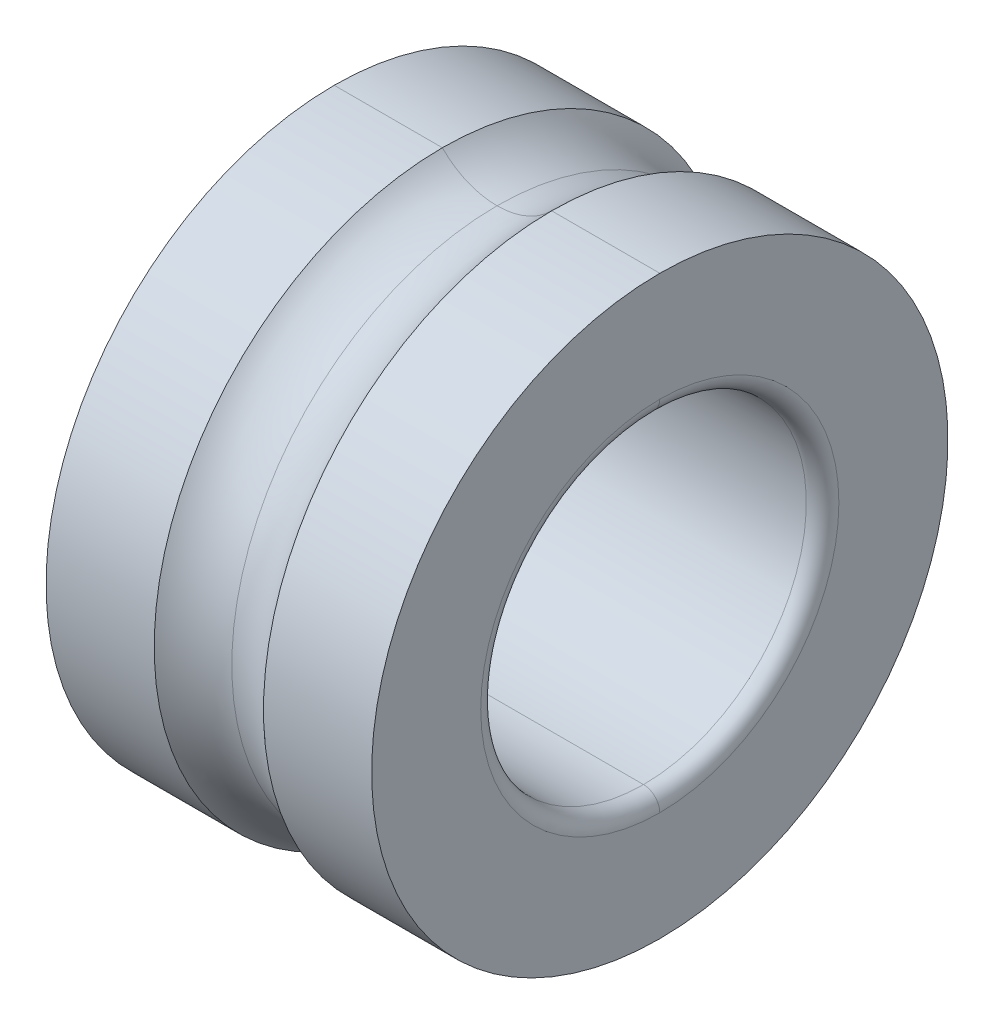
ISO-10303-21;
HEADER;
FILE_DESCRIPTION(('STEP AP214'),'2;1');
FILE_NAME('part.step','',(''),(''),'','','');
FILE_SCHEMA(('AUTOMOTIVE_DESIGN { 1 0 10303 214 1 1 1 1 }'));
ENDSEC;
DATA;
#1=APPLICATION_CONTEXT('core data for automotive mechanical design processes');
#2=APPLICATION_PROTOCOL_DEFINITION('international standard','automotive_design',2000,#1);
#3=PRODUCT_CONTEXT('',#1,'mechanical');
#4=PRODUCT('Part','Part','',(#3));
#5=PRODUCT_RELATED_PRODUCT_CATEGORY('part','',(#4));
#6=PRODUCT_DEFINITION_FORMATION('','',#4);
#7=PRODUCT_DEFINITION_CONTEXT('part definition',#1,'design');
#8=PRODUCT_DEFINITION('design','',#6,#7);
#9=PRODUCT_DEFINITION_SHAPE('','',#8);
#10=(LENGTH_UNIT() NAMED_UNIT(*) SI_UNIT(.MILLI.,.METRE.));
#11=(NAMED_UNIT(*) PLANE_ANGLE_UNIT() SI_UNIT($,.RADIAN.));
#12=(NAMED_UNIT(*) SI_UNIT($,.STERADIAN.) SOLID_ANGLE_UNIT());
#13=UNCERTAINTY_MEASURE_WITH_UNIT(LENGTH_MEASURE(1.E-05),#10,'distance_accuracy_value','');
#14=(GEOMETRIC_REPRESENTATION_CONTEXT(3) GLOBAL_UNCERTAINTY_ASSIGNED_CONTEXT((#13)) GLOBAL_UNIT_ASSIGNED_CONTEXT((#10,
#11,#12)) REPRESENTATION_CONTEXT('',''));
#15=CARTESIAN_POINT('',(0.,0.,0.));
#16=DIRECTION('',(0.,0.,1.));
#17=DIRECTION('',(1.,0.,0.));
#18=AXIS2_PLACEMENT_3D('',#15,#16,#17);
#19=CARTESIAN_POINT('',(-2.25171,0.,0.));
#20=DIRECTION('',(1.,0.,0.));
#21=DIRECTION('',(0.,-1.,0.));
#22=AXIS2_PLACEMENT_3D('',#19,#20,#21);
#23=TOROIDAL_SURFACE('',#22,2.75209,0.25019);
#24=CARTESIAN_POINT('',(-2.5019,0.,0.));
#25=DIRECTION('',(-1.,0.,0.));
#26=DIRECTION('',(0.,1.,0.));
#27=AXIS2_PLACEMENT_3D('',#24,#25,#26);
#28=CIRCLE('',#27,2.75209);
#29=CARTESIAN_POINT('',(-2.5019,2.75209,0.));
#30=VERTEX_POINT('',#29);
#31=CARTESIAN_POINT('',(-2.5019,-2.75209,0.));
#32=VERTEX_POINT('',#31);
#33=EDGE_CURVE('E198',#30,#32,#28,.T.);
#34=ORIENTED_EDGE('',*,*,#33,.T.);
#35=CARTESIAN_POINT('',(-2.25171,-2.75209,0.));
#36=DIRECTION('',(0.,0.,-1.));
#37=DIRECTION('',(-1.,0.,0.));
#38=AXIS2_PLACEMENT_3D('',#35,#36,#37);
#39=CIRCLE('',#38,0.25019);
#40=CARTESIAN_POINT('',(-2.25171,-2.5019,0.));
#41=VERTEX_POINT('',#40);
#42=EDGE_CURVE('E28',#32,#41,#39,.T.);
#43=ORIENTED_EDGE('',*,*,#42,.T.);
#44=CARTESIAN_POINT('',(-2.25171,0.,0.));
#45=DIRECTION('',(-1.,0.,0.));
#46=DIRECTION('',(0.,1.,0.));
#47=AXIS2_PLACEMENT_3D('',#44,#45,#46);
#48=CIRCLE('',#47,2.5019);
#49=CARTESIAN_POINT('',(-2.25171,2.5019,0.));
#50=VERTEX_POINT('',#49);
#51=EDGE_CURVE('E165',#50,#41,#48,.T.);
#52=ORIENTED_EDGE('',*,*,#51,.F.);
#53=CARTESIAN_POINT('',(-2.25171,2.75209,0.));
#54=DIRECTION('',(0.,0.,1.));
#55=DIRECTION('',(-1.,0.,0.));
#56=AXIS2_PLACEMENT_3D('',#53,#54,#55);
#57=CIRCLE('',#56,0.25019);
#58=EDGE_CURVE('E11',#30,#50,#57,.T.);
#59=ORIENTED_EDGE('',*,*,#58,.F.);
#60=EDGE_LOOP('',(#34,#43,#52,#59));
#61=FACE_BOUND('',#60,.T.);
#62=ADVANCED_FACE('F17',(#61),#23,.T.);
#63=CARTESIAN_POINT('',(-2.25171,0.,0.));
#64=DIRECTION('',(1.,0.,0.));
#65=DIRECTION('',(0.,-1.,0.));
#66=AXIS2_PLACEMENT_3D('',#63,#64,#65);
#67=TOROIDAL_SURFACE('',#66,2.75209,0.25019);
#68=CARTESIAN_POINT('',(-2.25171,0.,0.));
#69=DIRECTION('',(1.,0.,0.));
#70=DIRECTION('',(0.,1.,0.));
#71=AXIS2_PLACEMENT_3D('',#68,#69,#70);
#72=CIRCLE('',#71,2.5019);
#73=EDGE_CURVE('E201',#50,#41,#72,.T.);
#74=ORIENTED_EDGE('',*,*,#73,.T.);
#75=ORIENTED_EDGE('',*,*,#42,.F.);
#76=CARTESIAN_POINT('',(-2.5019,0.,0.));
#77=DIRECTION('',(1.,0.,0.));
#78=DIRECTION('',(0.,1.,0.));
#79=AXIS2_PLACEMENT_3D('',#76,#77,#78);
#80=CIRCLE('',#79,2.75209);
#81=EDGE_CURVE('E217',#30,#32,#80,.T.);
#82=ORIENTED_EDGE('',*,*,#81,.F.);
#83=ORIENTED_EDGE('',*,*,#58,.T.);
#84=EDGE_LOOP('',(#74,#75,#82,#83));
#85=FACE_BOUND('',#84,.T.);
#86=ADVANCED_FACE('F294',(#85),#67,.T.);
#87=CARTESIAN_POINT('',(-2.5019,0.,0.));
#88=DIRECTION('',(1.,0.,0.));
#89=DIRECTION('',(0.,1.,0.));
#90=AXIS2_PLACEMENT_3D('',#87,#88,#89);
#91=PLANE('',#90);
#92=ORIENTED_EDGE('',*,*,#33,.F.);
#93=ORIENTED_EDGE('',*,*,#81,.T.);
#94=EDGE_LOOP('',(#92,#93));
#95=FACE_BOUND('',#94,.T.);
#96=CARTESIAN_POINT('',(-2.5019,0.,0.));
#97=DIRECTION('',(1.,0.,0.));
#98=DIRECTION('',(0.,1.,0.));
#99=AXIS2_PLACEMENT_3D('',#96,#97,#98);
#100=CIRCLE('',#99,4.4283249);
#101=CARTESIAN_POINT('',(-2.5019,4.4283249,0.));
#102=VERTEX_POINT('',#101);
#103=CARTESIAN_POINT('',(-2.5019,-4.4283249,0.));
#104=VERTEX_POINT('',#103);
#105=EDGE_CURVE('E110',#102,#104,#100,.T.);
#106=ORIENTED_EDGE('',*,*,#105,.F.);
#107=CARTESIAN_POINT('',(-2.5019,0.,0.));
#108=DIRECTION('',(-1.,0.,0.));
#109=DIRECTION('',(0.,1.,0.));
#110=AXIS2_PLACEMENT_3D('',#107,#108,#109);
#111=CIRCLE('',#110,4.4283249);
#112=EDGE_CURVE('E194',#102,#104,#111,.T.);
#113=ORIENTED_EDGE('',*,*,#112,.T.);
#114=EDGE_LOOP('',(#106,#113));
#115=FACE_BOUND('',#114,.T.);
#116=ADVANCED_FACE('F289',(#95,#115),#91,.F.);
#117=CARTESIAN_POINT('',(-2.75209,0.,0.));
#118=DIRECTION('',(1.,0.,0.));
#119=DIRECTION('',(0.,-1.,0.));
#120=AXIS2_PLACEMENT_3D('',#117,#118,#119);
#121=CYLINDRICAL_SURFACE('',#120,4.4283249);
#122=CARTESIAN_POINT('',(-0.839755569912454,0.,0.));
#123=DIRECTION('',(-1.,0.,0.));
#124=DIRECTION('',(0.,1.,0.));
#125=AXIS2_PLACEMENT_3D('',#122,#123,#124);
#126=CIRCLE('',#125,4.4283249);
#127=CARTESIAN_POINT('',(-0.839755569912454,4.4283249,0.));
#128=VERTEX_POINT('',#127);
#129=CARTESIAN_POINT('',(-0.839755569912454,-4.4283249,0.));
#130=VERTEX_POINT('',#129);
#131=EDGE_CURVE('E128',#128,#130,#126,.T.);
#132=ORIENTED_EDGE('',*,*,#131,.T.);
#133=DIRECTION('',(-1.,0.,0.));
#134=VECTOR('',#133,1.);
#135=CARTESIAN_POINT('',(-0.839755569912453,-4.4283249,0.));
#136=LINE('',#135,#134);
#137=EDGE_CURVE('E103',#130,#104,#136,.T.);
#138=ORIENTED_EDGE('',*,*,#137,.T.);
#139=ORIENTED_EDGE('',*,*,#112,.F.);
#140=DIRECTION('',(-1.,0.,0.));
#141=VECTOR('',#140,1.);
#142=CARTESIAN_POINT('',(-0.839755569912453,4.4283249,0.));
#143=LINE('',#142,#141);
#144=EDGE_CURVE('E115',#128,#102,#143,.T.);
#145=ORIENTED_EDGE('',*,*,#144,.F.);
#146=EDGE_LOOP('',(#132,#138,#139,#145));
#147=FACE_BOUND('',#146,.T.);
#148=ADVANCED_FACE('F129',(#147),#121,.T.);
#149=CARTESIAN_POINT('',(-2.75209,0.,0.));
#150=DIRECTION('',(1.,0.,0.));
#151=DIRECTION('',(0.,-1.,0.));
#152=AXIS2_PLACEMENT_3D('',#149,#150,#151);
#153=CYLINDRICAL_SURFACE('',#152,4.4283249);
#154=ORIENTED_EDGE('',*,*,#105,.T.);
#155=ORIENTED_EDGE('',*,*,#137,.F.);
#156=CARTESIAN_POINT('',(-0.839755569912454,0.,0.));
#157=DIRECTION('',(1.,0.,0.));
#158=DIRECTION('',(0.,1.,0.));
#159=AXIS2_PLACEMENT_3D('',#156,#157,#158);
#160=CIRCLE('',#159,4.4283249);
#161=EDGE_CURVE('E107',#128,#130,#160,.T.);
#162=ORIENTED_EDGE('',*,*,#161,.F.);
#163=ORIENTED_EDGE('',*,*,#144,.T.);
#164=EDGE_LOOP('',(#154,#155,#162,#163));
#165=FACE_BOUND('',#164,.T.);
#166=ADVANCED_FACE('F105',(#165),#153,.T.);
#167=CARTESIAN_POINT('',(0.,0.,0.));
#168=DIRECTION('',(1.,0.,0.));
#169=DIRECTION('',(0.,-1.,0.));
#170=AXIS2_PLACEMENT_3D('',#167,#168,#169);
#171=TOROIDAL_SURFACE('',#170,5.25145,1.175893);
#172=CARTESIAN_POINT('',(0.,0.,0.));
#173=DIRECTION('',(1.,0.,0.));
#174=DIRECTION('',(0.,0.,-1.));
#175=AXIS2_PLACEMENT_3D('',#172,#173,#174);
#176=CIRCLE('',#175,4.075557);
#177=CARTESIAN_POINT('',(0.,4.075557,0.));
#178=VERTEX_POINT('',#177);
#179=CARTESIAN_POINT('',(0.,-4.075557,0.));
#180=VERTEX_POINT('',#179);
#181=EDGE_CURVE('E184',#178,#180,#176,.T.);
#182=ORIENTED_EDGE('',*,*,#181,.F.);
#183=CARTESIAN_POINT('',(0.,5.25145,0.));
#184=DIRECTION('',(0.,0.,-1.));
#185=DIRECTION('',(0.714142842854285,-0.7,0.));
#186=AXIS2_PLACEMENT_3D('',#183,#184,#185);
#187=CIRCLE('',#186,1.175893);
#188=EDGE_CURVE('E124',#178,#128,#187,.T.);
#189=ORIENTED_EDGE('',*,*,#188,.T.);
#190=ORIENTED_EDGE('',*,*,#161,.T.);
#191=CARTESIAN_POINT('',(0.,-5.25145,0.));
#192=DIRECTION('',(0.,0.,1.));
#193=DIRECTION('',(0.714142842854285,0.7,0.));
#194=AXIS2_PLACEMENT_3D('',#191,#192,#193);
#195=CIRCLE('',#194,1.175893);
#196=EDGE_CURVE('E122',#180,#130,#195,.T.);
#197=ORIENTED_EDGE('',*,*,#196,.F.);
#198=EDGE_LOOP('',(#182,#189,#190,#197));
#199=FACE_BOUND('',#198,.T.);
#200=ADVANCED_FACE('F120',(#199),#171,.F.);
#201=CARTESIAN_POINT('',(0.,0.,0.));
#202=DIRECTION('',(1.,0.,0.));
#203=DIRECTION('',(0.,-1.,0.));
#204=AXIS2_PLACEMENT_3D('',#201,#202,#203);
#205=TOROIDAL_SURFACE('',#204,5.25145,1.175893);
#206=CARTESIAN_POINT('',(0.,0.,0.));
#207=DIRECTION('',(1.,0.,0.));
#208=DIRECTION('',(0.,0.,-1.));
#209=AXIS2_PLACEMENT_3D('',#206,#207,#208);
#210=CIRCLE('',#209,4.075557);
#211=EDGE_CURVE('E135',#180,#178,#210,.T.);
#212=ORIENTED_EDGE('',*,*,#211,.F.);
#213=ORIENTED_EDGE('',*,*,#196,.T.);
#214=ORIENTED_EDGE('',*,*,#131,.F.);
#215=ORIENTED_EDGE('',*,*,#188,.F.);
#216=EDGE_LOOP('',(#212,#213,#214,#215));
#217=FACE_BOUND('',#216,.T.);
#218=ADVANCED_FACE('F133',(#217),#205,.F.);
#219=CARTESIAN_POINT('',(-2.75209,0.,0.));
#220=DIRECTION('',(1.,0.,0.));
#221=DIRECTION('',(0.,-1.,0.));
#222=AXIS2_PLACEMENT_3D('',#219,#220,#221);
#223=CYLINDRICAL_SURFACE('',#222,4.4283249);
#224=CARTESIAN_POINT('',(2.5019,0.,0.));
#225=DIRECTION('',(-1.,0.,0.));
#226=DIRECTION('',(0.,1.,0.));
#227=AXIS2_PLACEMENT_3D('',#224,#225,#226);
#228=CIRCLE('',#227,4.4283249);
#229=CARTESIAN_POINT('',(2.5019,4.4283249,0.));
#230=VERTEX_POINT('',#229);
#231=CARTESIAN_POINT('',(2.5019,-4.4283249,0.));
#232=VERTEX_POINT('',#231);
#233=EDGE_CURVE('E191',#230,#232,#228,.T.);
#234=ORIENTED_EDGE('',*,*,#233,.T.);
#235=DIRECTION('',(-1.,0.,0.));
#236=VECTOR('',#235,1.);
#237=CARTESIAN_POINT('',(2.5019,-4.4283249,0.));
#238=LINE('',#237,#236);
#239=CARTESIAN_POINT('',(0.839755569912454,-4.4283249,0.));
#240=VERTEX_POINT('',#239);
#241=EDGE_CURVE('E145',#232,#240,#238,.T.);
#242=ORIENTED_EDGE('',*,*,#241,.T.);
#243=CARTESIAN_POINT('',(0.839755569912454,0.,0.));
#244=DIRECTION('',(-1.,0.,0.));
#245=DIRECTION('',(0.,1.,0.));
#246=AXIS2_PLACEMENT_3D('',#243,#244,#245);
#247=CIRCLE('',#246,4.4283249);
#248=CARTESIAN_POINT('',(0.839755569912454,4.4283249,0.));
#249=VERTEX_POINT('',#248);
#250=EDGE_CURVE('E173',#249,#240,#247,.T.);
#251=ORIENTED_EDGE('',*,*,#250,.F.);
#252=DIRECTION('',(-1.,0.,0.));
#253=VECTOR('',#252,1.);
#254=CARTESIAN_POINT('',(2.5019,4.4283249,0.));
#255=LINE('',#254,#253);
#256=EDGE_CURVE('E138',#230,#249,#255,.T.);
#257=ORIENTED_EDGE('',*,*,#256,.F.);
#258=EDGE_LOOP('',(#234,#242,#251,#257));
#259=FACE_BOUND('',#258,.T.);
#260=ADVANCED_FACE('F241',(#259),#223,.T.);
#261=CARTESIAN_POINT('',(-2.75209,0.,0.));
#262=DIRECTION('',(1.,0.,0.));
#263=DIRECTION('',(0.,-1.,0.));
#264=AXIS2_PLACEMENT_3D('',#261,#262,#263);
#265=CYLINDRICAL_SURFACE('',#264,4.4283249);
#266=CARTESIAN_POINT('',(0.839755569912454,0.,0.));
#267=DIRECTION('',(1.,0.,0.));
#268=DIRECTION('',(0.,1.,0.));
#269=AXIS2_PLACEMENT_3D('',#266,#267,#268);
#270=CIRCLE('',#269,4.4283249);
#271=EDGE_CURVE('E176',#249,#240,#270,.T.);
#272=ORIENTED_EDGE('',*,*,#271,.T.);
#273=ORIENTED_EDGE('',*,*,#241,.F.);
#274=CARTESIAN_POINT('',(2.5019,0.,0.));
#275=DIRECTION('',(1.,0.,0.));
#276=DIRECTION('',(0.,1.,0.));
#277=AXIS2_PLACEMENT_3D('',#274,#275,#276);
#278=CIRCLE('',#277,4.4283249);
#279=EDGE_CURVE('E213',#230,#232,#278,.T.);
#280=ORIENTED_EDGE('',*,*,#279,.F.);
#281=ORIENTED_EDGE('',*,*,#256,.T.);
#282=EDGE_LOOP('',(#272,#273,#280,#281));
#283=FACE_BOUND('',#282,.T.);
#284=ADVANCED_FACE('F250',(#283),#265,.T.);
#285=CARTESIAN_POINT('',(2.5019,0.,0.));
#286=DIRECTION('',(1.,0.,0.));
#287=DIRECTION('',(0.,1.,0.));
#288=AXIS2_PLACEMENT_3D('',#285,#286,#287);
#289=PLANE('',#288);
#290=CARTESIAN_POINT('',(2.5019,0.,0.));
#291=DIRECTION('',(1.,0.,0.));
#292=DIRECTION('',(0.,1.,0.));
#293=AXIS2_PLACEMENT_3D('',#290,#291,#292);
#294=CIRCLE('',#293,2.75209);
#295=CARTESIAN_POINT('',(2.5019,2.75209,0.));
#296=VERTEX_POINT('',#295);
#297=CARTESIAN_POINT('',(2.5019,-2.75209,0.));
#298=VERTEX_POINT('',#297);
#299=EDGE_CURVE('E204',#296,#298,#294,.T.);
#300=ORIENTED_EDGE('',*,*,#299,.F.);
#301=CARTESIAN_POINT('',(2.5019,0.,0.));
#302=DIRECTION('',(-1.,0.,0.));
#303=DIRECTION('',(0.,1.,0.));
#304=AXIS2_PLACEMENT_3D('',#301,#302,#303);
#305=CIRCLE('',#304,2.75209);
#306=EDGE_CURVE('E189',#296,#298,#305,.T.);
#307=ORIENTED_EDGE('',*,*,#306,.T.);
#308=EDGE_LOOP('',(#300,#307));
#309=FACE_BOUND('',#308,.T.);
#310=ORIENTED_EDGE('',*,*,#233,.F.);
#311=ORIENTED_EDGE('',*,*,#279,.T.);
#312=EDGE_LOOP('',(#310,#311));
#313=FACE_BOUND('',#312,.T.);
#314=ADVANCED_FACE('F331',(#309,#313),#289,.T.);
#315=CARTESIAN_POINT('',(2.25171,0.,0.));
#316=DIRECTION('',(1.,0.,0.));
#317=DIRECTION('',(0.,-1.,0.));
#318=AXIS2_PLACEMENT_3D('',#315,#316,#317);
#319=TOROIDAL_SURFACE('',#318,2.75209,0.25019);
#320=CARTESIAN_POINT('',(2.25171,0.,0.));
#321=DIRECTION('',(-1.,0.,0.));
#322=DIRECTION('',(0.,1.,0.));
#323=AXIS2_PLACEMENT_3D('',#320,#321,#322);
#324=CIRCLE('',#323,2.5019);
#325=CARTESIAN_POINT('',(2.25171,2.5019,0.));
#326=VERTEX_POINT('',#325);
#327=CARTESIAN_POINT('',(2.25171,-2.5019,0.));
#328=VERTEX_POINT('',#327);
#329=EDGE_CURVE('E150',#326,#328,#324,.T.);
#330=ORIENTED_EDGE('',*,*,#329,.T.);
#331=CARTESIAN_POINT('',(2.25171,-2.75209,0.));
#332=DIRECTION('',(0.,0.,-1.));
#333=DIRECTION('',(0.,1.,0.));
#334=AXIS2_PLACEMENT_3D('',#331,#332,#333);
#335=CIRCLE('',#334,0.25019);
#336=EDGE_CURVE('E21',#328,#298,#335,.T.);
#337=ORIENTED_EDGE('',*,*,#336,.T.);
#338=ORIENTED_EDGE('',*,*,#306,.F.);
#339=CARTESIAN_POINT('',(2.25171,2.75209,0.));
#340=DIRECTION('',(0.,0.,1.));
#341=DIRECTION('',(0.,-1.,0.));
#342=AXIS2_PLACEMENT_3D('',#339,#340,#341);
#343=CIRCLE('',#342,0.25019);
#344=EDGE_CURVE('E192',#326,#296,#343,.T.);
#345=ORIENTED_EDGE('',*,*,#344,.F.);
#346=EDGE_LOOP('',(#330,#337,#338,#345));
#347=FACE_BOUND('',#346,.T.);
#348=ADVANCED_FACE('F336',(#347),#319,.T.);
#349=CARTESIAN_POINT('',(2.25171,0.,0.));
#350=DIRECTION('',(1.,0.,0.));
#351=DIRECTION('',(0.,-1.,0.));
#352=AXIS2_PLACEMENT_3D('',#349,#350,#351);
#353=TOROIDAL_SURFACE('',#352,2.75209,0.25019);
#354=ORIENTED_EDGE('',*,*,#299,.T.);
#355=ORIENTED_EDGE('',*,*,#336,.F.);
#356=CARTESIAN_POINT('',(2.25171,0.,0.));
#357=DIRECTION('',(1.,0.,0.));
#358=DIRECTION('',(0.,1.,0.));
#359=AXIS2_PLACEMENT_3D('',#356,#357,#358);
#360=CIRCLE('',#359,2.5019);
#361=EDGE_CURVE('E148',#326,#328,#360,.T.);
#362=ORIENTED_EDGE('',*,*,#361,.F.);
#363=ORIENTED_EDGE('',*,*,#344,.T.);
#364=EDGE_LOOP('',(#354,#355,#362,#363));
#365=FACE_BOUND('',#364,.T.);
#366=ADVANCED_FACE('F382',(#365),#353,.T.);
#367=CARTESIAN_POINT('',(-2.75209,0.,0.));
#368=DIRECTION('',(1.,0.,0.));
#369=DIRECTION('',(0.,-1.,0.));
#370=AXIS2_PLACEMENT_3D('',#367,#368,#369);
#371=CYLINDRICAL_SURFACE('',#370,2.5019);
#372=ORIENTED_EDGE('',*,*,#361,.T.);
#373=DIRECTION('',(1.,0.,0.));
#374=VECTOR('',#373,1.);
#375=CARTESIAN_POINT('',(-2.25171,-2.5019,0.));
#376=LINE('',#375,#374);
#377=EDGE_CURVE('E154',#41,#328,#376,.T.);
#378=ORIENTED_EDGE('',*,*,#377,.F.);
#379=ORIENTED_EDGE('',*,*,#73,.F.);
#380=DIRECTION('',(1.,0.,0.));
#381=VECTOR('',#380,1.);
#382=CARTESIAN_POINT('',(-2.25171,2.5019,0.));
#383=LINE('',#382,#381);
#384=EDGE_CURVE('E153',#50,#326,#383,.T.);
#385=ORIENTED_EDGE('',*,*,#384,.T.);
#386=EDGE_LOOP('',(#372,#378,#379,#385));
#387=FACE_BOUND('',#386,.T.);
#388=ADVANCED_FACE('F274',(#387),#371,.F.);
#389=CARTESIAN_POINT('',(-2.75209,0.,0.));
#390=DIRECTION('',(1.,0.,0.));
#391=DIRECTION('',(0.,-1.,0.));
#392=AXIS2_PLACEMENT_3D('',#389,#390,#391);
#393=CYLINDRICAL_SURFACE('',#392,2.5019);
#394=ORIENTED_EDGE('',*,*,#51,.T.);
#395=ORIENTED_EDGE('',*,*,#377,.T.);
#396=ORIENTED_EDGE('',*,*,#329,.F.);
#397=ORIENTED_EDGE('',*,*,#384,.F.);
#398=EDGE_LOOP('',(#394,#395,#396,#397));
#399=FACE_BOUND('',#398,.T.);
#400=ADVANCED_FACE('F19',(#399),#393,.F.);
#401=CARTESIAN_POINT('',(0.,0.,0.));
#402=DIRECTION('',(1.,0.,0.));
#403=DIRECTION('',(0.,-1.,0.));
#404=AXIS2_PLACEMENT_3D('',#401,#402,#403);
#405=TOROIDAL_SURFACE('',#404,5.25145,1.175893);
#406=CARTESIAN_POINT('',(0.,-5.25145,0.));
#407=DIRECTION('',(0.,0.,1.));
#408=DIRECTION('',(0.714142842854285,0.7,0.));
#409=AXIS2_PLACEMENT_3D('',#406,#407,#408);
#410=CIRCLE('',#409,1.175893);
#411=EDGE_CURVE('E180',#240,#180,#410,.T.);
#412=ORIENTED_EDGE('',*,*,#411,.T.);
#413=ORIENTED_EDGE('',*,*,#211,.T.);
#414=CARTESIAN_POINT('',(0.,5.25145,0.));
#415=DIRECTION('',(0.,0.,-1.));
#416=DIRECTION('',(0.714142842854285,-0.7,0.));
#417=AXIS2_PLACEMENT_3D('',#414,#415,#416);
#418=CIRCLE('',#417,1.175893);
#419=EDGE_CURVE('E187',#249,#178,#418,.T.);
#420=ORIENTED_EDGE('',*,*,#419,.F.);
#421=ORIENTED_EDGE('',*,*,#250,.T.);
#422=EDGE_LOOP('',(#412,#413,#420,#421));
#423=FACE_BOUND('',#422,.T.);
#424=ADVANCED_FACE('F248',(#423),#405,.F.);
#425=CARTESIAN_POINT('',(0.,0.,0.));
#426=DIRECTION('',(1.,0.,0.));
#427=DIRECTION('',(0.,-1.,0.));
#428=AXIS2_PLACEMENT_3D('',#425,#426,#427);
#429=TOROIDAL_SURFACE('',#428,5.25145,1.175893);
#430=ORIENTED_EDGE('',*,*,#419,.T.);
#431=ORIENTED_EDGE('',*,*,#181,.T.);
#432=ORIENTED_EDGE('',*,*,#411,.F.);
#433=ORIENTED_EDGE('',*,*,#271,.F.);
#434=EDGE_LOOP('',(#430,#431,#432,#433));
#435=FACE_BOUND('',#434,.T.);
#436=ADVANCED_FACE('F252',(#435),#429,.F.);
#437=CLOSED_SHELL('',(#62,#86,#116,#148,#166,#200,#218,#260,#284,#314,#348,#366,#388,#400,#424,#436));
#438=MANIFOLD_SOLID_BREP('B1',#437);
#439=ADVANCED_BREP_SHAPE_REPRESENTATION('',(#18,#438),#14);
#440=SHAPE_DEFINITION_REPRESENTATION(#9,#439);
ENDSEC;
END-ISO-10303-21;
